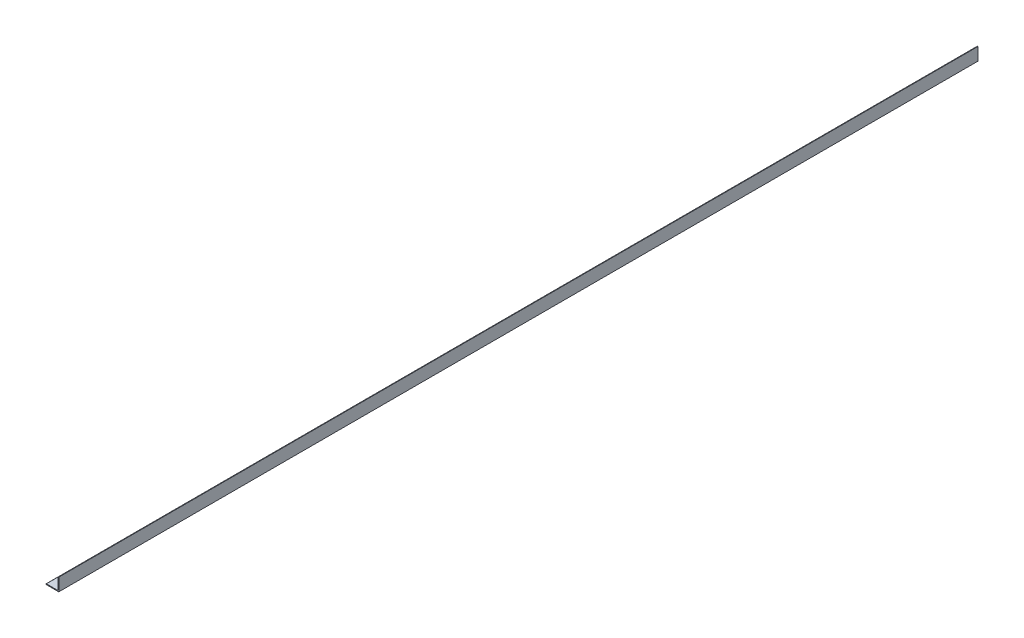
ISO-10303-21;
HEADER;
FILE_DESCRIPTION(('STEP AP214'),'2;1');
FILE_NAME('part.step','',(''),(''),'','','');
FILE_SCHEMA(('AUTOMOTIVE_DESIGN { 1 0 10303 214 1 1 1 1 }'));
ENDSEC;
DATA;
#1=APPLICATION_CONTEXT('core data for automotive mechanical design processes');
#2=APPLICATION_PROTOCOL_DEFINITION('international standard','automotive_design',2000,#1);
#3=PRODUCT_CONTEXT('',#1,'mechanical');
#4=PRODUCT('Part','Part','',(#3));
#5=PRODUCT_RELATED_PRODUCT_CATEGORY('part','',(#4));
#6=PRODUCT_DEFINITION_FORMATION('','',#4);
#7=PRODUCT_DEFINITION_CONTEXT('part definition',#1,'design');
#8=PRODUCT_DEFINITION('design','',#6,#7);
#9=PRODUCT_DEFINITION_SHAPE('','',#8);
#10=(LENGTH_UNIT() NAMED_UNIT(*) SI_UNIT(.MILLI.,.METRE.));
#11=(NAMED_UNIT(*) PLANE_ANGLE_UNIT() SI_UNIT($,.RADIAN.));
#12=(NAMED_UNIT(*) SI_UNIT($,.STERADIAN.) SOLID_ANGLE_UNIT());
#13=UNCERTAINTY_MEASURE_WITH_UNIT(LENGTH_MEASURE(1.E-05),#10,'distance_accuracy_value','');
#14=(GEOMETRIC_REPRESENTATION_CONTEXT(3) GLOBAL_UNCERTAINTY_ASSIGNED_CONTEXT((#13)) GLOBAL_UNIT_ASSIGNED_CONTEXT((#10,
#11,#12)) REPRESENTATION_CONTEXT('',''));
#15=CARTESIAN_POINT('',(0.,0.,0.));
#16=DIRECTION('',(0.,0.,1.));
#17=DIRECTION('',(1.,0.,0.));
#18=AXIS2_PLACEMENT_3D('',#15,#16,#17);
#19=CARTESIAN_POINT('',(-12.7,-11.90625,914.4));
#20=DIRECTION('',(1.,0.,0.));
#21=DIRECTION('',(0.,0.,-1.));
#22=AXIS2_PLACEMENT_3D('',#19,#20,#21);
#23=PLANE('',#22);
#24=DIRECTION('',(0.,-1.,0.));
#25=VECTOR('',#24,1.);
#26=CARTESIAN_POINT('',(-12.7,-11.90625,-914.4));
#27=LINE('',#26,#25);
#28=CARTESIAN_POINT('',(-12.7,-11.90625,-914.4));
#29=VERTEX_POINT('',#28);
#30=CARTESIAN_POINT('',(-12.7,-12.7,-914.4));
#31=VERTEX_POINT('',#30);
#32=EDGE_CURVE('E361',#29,#31,#27,.T.);
#33=ORIENTED_EDGE('',*,*,#32,.T.);
#34=DIRECTION('',(0.,0.,-1.));
#35=VECTOR('',#34,1.);
#36=CARTESIAN_POINT('',(-12.7,-12.7,914.4));
#37=LINE('',#36,#35);
#38=CARTESIAN_POINT('',(-12.7,-12.7,914.4));
#39=VERTEX_POINT('',#38);
#40=EDGE_CURVE('E11',#39,#31,#37,.T.);
#41=ORIENTED_EDGE('',*,*,#40,.F.);
#42=DIRECTION('',(0.,-1.,0.));
#43=VECTOR('',#42,1.);
#44=CARTESIAN_POINT('',(-12.7,-11.90625,914.4));
#45=LINE('',#44,#43);
#46=CARTESIAN_POINT('',(-12.7,-11.90625,914.4));
#47=VERTEX_POINT('',#46);
#48=EDGE_CURVE('E362',#47,#39,#45,.T.);
#49=ORIENTED_EDGE('',*,*,#48,.F.);
#50=DIRECTION('',(0.,0.,-1.));
#51=VECTOR('',#50,1.);
#52=CARTESIAN_POINT('',(-12.7,-11.90625,914.4));
#53=LINE('',#52,#51);
#54=EDGE_CURVE('E382',#47,#29,#53,.T.);
#55=ORIENTED_EDGE('',*,*,#54,.T.);
#56=EDGE_LOOP('',(#33,#41,#49,#55));
#57=FACE_BOUND('',#56,.T.);
#58=ADVANCED_FACE('F37',(#57),#23,.F.);
#59=CARTESIAN_POINT('',(-12.7,-12.7,914.4));
#60=DIRECTION('',(0.,1.,0.));
#61=DIRECTION('',(-1.,0.,0.));
#62=AXIS2_PLACEMENT_3D('',#59,#60,#61);
#63=PLANE('',#62);
#64=DIRECTION('',(0.,0.,-1.));
#65=VECTOR('',#64,1.);
#66=CARTESIAN_POINT('',(1.4605,-12.7,701.675));
#67=LINE('',#66,#65);
#68=CARTESIAN_POINT('',(1.4605,-12.7,720.725));
#69=VERTEX_POINT('',#68);
#70=CARTESIAN_POINT('',(1.4605,-12.7,701.675));
#71=VERTEX_POINT('',#70);
#72=EDGE_CURVE('E215',#69,#71,#67,.T.);
#73=ORIENTED_EDGE('',*,*,#72,.T.);
#74=CARTESIAN_POINT('',(-1.5875,-12.7,701.675));
#75=DIRECTION('',(0.,1.,0.));
#76=DIRECTION('',(0.,0.,1.));
#77=AXIS2_PLACEMENT_3D('',#74,#75,#76);
#78=CIRCLE('',#77,3.048);
#79=CARTESIAN_POINT('',(-4.6355,-12.7,701.675));
#80=VERTEX_POINT('',#79);
#81=EDGE_CURVE('E207',#71,#80,#78,.T.);
#82=ORIENTED_EDGE('',*,*,#81,.T.);
#83=DIRECTION('',(0.,0.,1.));
#84=VECTOR('',#83,1.);
#85=CARTESIAN_POINT('',(-4.6355,-12.7,701.675));
#86=LINE('',#85,#84);
#87=CARTESIAN_POINT('',(-4.63549999999999,-12.7,720.725));
#88=VERTEX_POINT('',#87);
#89=EDGE_CURVE('E218',#80,#88,#86,.T.);
#90=ORIENTED_EDGE('',*,*,#89,.T.);
#91=CARTESIAN_POINT('',(-1.58749999999999,-12.7,720.725));
#92=DIRECTION('',(0.,1.,0.));
#93=DIRECTION('',(0.,0.,1.));
#94=AXIS2_PLACEMENT_3D('',#91,#92,#93);
#95=CIRCLE('',#94,3.048);
#96=EDGE_CURVE('E51',#88,#69,#95,.T.);
#97=ORIENTED_EDGE('',*,*,#96,.T.);
#98=EDGE_LOOP('',(#73,#82,#90,#97));
#99=FACE_BOUND('',#98,.T.);
#100=DIRECTION('',(0.,0.,-1.));
#101=VECTOR('',#100,1.);
#102=CARTESIAN_POINT('',(1.46049999999995,-12.7,285.75));
#103=LINE('',#102,#101);
#104=CARTESIAN_POINT('',(1.46049999999996,-12.7,304.8));
#105=VERTEX_POINT('',#104);
#106=CARTESIAN_POINT('',(1.46049999999995,-12.7,285.75));
#107=VERTEX_POINT('',#106);
#108=EDGE_CURVE('E253',#105,#107,#103,.T.);
#109=ORIENTED_EDGE('',*,*,#108,.T.);
#110=CARTESIAN_POINT('',(-1.58750000000005,-12.7,285.75));
#111=DIRECTION('',(0.,1.,0.));
#112=DIRECTION('',(0.,0.,1.));
#113=AXIS2_PLACEMENT_3D('',#110,#111,#112);
#114=CIRCLE('',#113,3.048);
#115=CARTESIAN_POINT('',(-4.63550000000005,-12.7,285.75));
#116=VERTEX_POINT('',#115);
#117=EDGE_CURVE('E245',#107,#116,#114,.T.);
#118=ORIENTED_EDGE('',*,*,#117,.T.);
#119=DIRECTION('',(0.,0.,1.));
#120=VECTOR('',#119,1.);
#121=CARTESIAN_POINT('',(-4.63550000000005,-12.7,285.75));
#122=LINE('',#121,#120);
#123=CARTESIAN_POINT('',(-4.63550000000004,-12.7,304.8));
#124=VERTEX_POINT('',#123);
#125=EDGE_CURVE('E248',#116,#124,#122,.T.);
#126=ORIENTED_EDGE('',*,*,#125,.T.);
#127=CARTESIAN_POINT('',(-1.58750000000004,-12.7,304.8));
#128=DIRECTION('',(0.,1.,0.));
#129=DIRECTION('',(0.,0.,1.));
#130=AXIS2_PLACEMENT_3D('',#127,#128,#129);
#131=CIRCLE('',#130,3.048);
#132=EDGE_CURVE('E59',#124,#105,#131,.T.);
#133=ORIENTED_EDGE('',*,*,#132,.T.);
#134=EDGE_LOOP('',(#109,#118,#126,#133));
#135=FACE_BOUND('',#134,.T.);
#136=DIRECTION('',(0.,0.,1.));
#137=VECTOR('',#136,1.);
#138=CARTESIAN_POINT('',(-4.63550000000008,-12.7,-317.5));
#139=LINE('',#138,#137);
#140=CARTESIAN_POINT('',(-4.63550000000008,-12.7,-336.55));
#141=VERTEX_POINT('',#140);
#142=CARTESIAN_POINT('',(-4.63550000000008,-12.7,-317.5));
#143=VERTEX_POINT('',#142);
#144=EDGE_CURVE('E285',#141,#143,#139,.T.);
#145=ORIENTED_EDGE('',*,*,#144,.T.);
#146=CARTESIAN_POINT('',(-1.58750000000008,-12.7,-317.5));
#147=DIRECTION('',(0.,1.,0.));
#148=DIRECTION('',(0.,0.,-1.));
#149=AXIS2_PLACEMENT_3D('',#146,#147,#148);
#150=CIRCLE('',#149,3.048);
#151=CARTESIAN_POINT('',(1.46049999999992,-12.7,-317.5));
#152=VERTEX_POINT('',#151);
#153=EDGE_CURVE('E275',#143,#152,#150,.T.);
#154=ORIENTED_EDGE('',*,*,#153,.T.);
#155=DIRECTION('',(0.,0.,-1.));
#156=VECTOR('',#155,1.);
#157=CARTESIAN_POINT('',(1.46049999999992,-12.7,-317.5));
#158=LINE('',#157,#156);
#159=CARTESIAN_POINT('',(1.46049999999992,-12.7,-336.55));
#160=VERTEX_POINT('',#159);
#161=EDGE_CURVE('E278',#152,#160,#158,.T.);
#162=ORIENTED_EDGE('',*,*,#161,.T.);
#163=CARTESIAN_POINT('',(-1.58750000000008,-12.7,-336.55));
#164=DIRECTION('',(0.,1.,0.));
#165=DIRECTION('',(0.,0.,-1.));
#166=AXIS2_PLACEMENT_3D('',#163,#164,#165);
#167=CIRCLE('',#166,3.048);
#168=EDGE_CURVE('E282',#160,#141,#167,.T.);
#169=ORIENTED_EDGE('',*,*,#168,.T.);
#170=EDGE_LOOP('',(#145,#154,#162,#169));
#171=FACE_BOUND('',#170,.T.);
#172=DIRECTION('',(0.,0.,1.));
#173=VECTOR('',#172,1.);
#174=CARTESIAN_POINT('',(-4.63550000000002,-12.7,-717.55));
#175=LINE('',#174,#173);
#176=CARTESIAN_POINT('',(-4.63550000000002,-12.7,-736.6));
#177=VERTEX_POINT('',#176);
#178=CARTESIAN_POINT('',(-4.63550000000002,-12.7,-717.55));
#179=VERTEX_POINT('',#178);
#180=EDGE_CURVE('E317',#177,#179,#175,.T.);
#181=ORIENTED_EDGE('',*,*,#180,.T.);
#182=CARTESIAN_POINT('',(-1.58750000000002,-12.7,-717.55));
#183=DIRECTION('',(0.,1.,0.));
#184=DIRECTION('',(0.,0.,-1.));
#185=AXIS2_PLACEMENT_3D('',#182,#183,#184);
#186=CIRCLE('',#185,3.048);
#187=CARTESIAN_POINT('',(1.46049999999998,-12.7,-717.55));
#188=VERTEX_POINT('',#187);
#189=EDGE_CURVE('E307',#179,#188,#186,.T.);
#190=ORIENTED_EDGE('',*,*,#189,.T.);
#191=DIRECTION('',(0.,0.,-1.));
#192=VECTOR('',#191,1.);
#193=CARTESIAN_POINT('',(1.46049999999998,-12.7,-717.55));
#194=LINE('',#193,#192);
#195=CARTESIAN_POINT('',(1.46049999999998,-12.7,-736.6));
#196=VERTEX_POINT('',#195);
#197=EDGE_CURVE('E310',#188,#196,#194,.T.);
#198=ORIENTED_EDGE('',*,*,#197,.T.);
#199=CARTESIAN_POINT('',(-1.58750000000002,-12.7,-736.6));
#200=DIRECTION('',(0.,1.,0.));
#201=DIRECTION('',(0.,0.,-1.));
#202=AXIS2_PLACEMENT_3D('',#199,#200,#201);
#203=CIRCLE('',#202,3.048);
#204=EDGE_CURVE('E314',#196,#177,#203,.T.);
#205=ORIENTED_EDGE('',*,*,#204,.T.);
#206=EDGE_LOOP('',(#181,#190,#198,#205));
#207=FACE_BOUND('',#206,.T.);
#208=CARTESIAN_POINT('',(-1.5875,-12.7,661.924));
#209=DIRECTION('',(0.,1.,0.));
#210=DIRECTION('',(0.,0.,1.));
#211=AXIS2_PLACEMENT_3D('',#208,#209,#210);
#212=CIRCLE('',#211,2.5527);
#213=CARTESIAN_POINT('',(-1.5875,-12.7,664.4767));
#214=VERTEX_POINT('',#213);
#215=EDGE_CURVE('E340',#214,#214,#212,.T.);
#216=ORIENTED_EDGE('',*,*,#215,.T.);
#217=EDGE_LOOP('',(#216));
#218=FACE_BOUND('',#217,.T.);
#219=CARTESIAN_POINT('',(-1.5875,-12.7,206.248));
#220=DIRECTION('',(0.,1.,0.));
#221=DIRECTION('',(0.,0.,1.));
#222=AXIS2_PLACEMENT_3D('',#219,#220,#221);
#223=CIRCLE('',#222,2.5527);
#224=CARTESIAN_POINT('',(-1.5875,-12.7,208.8007));
#225=VERTEX_POINT('',#224);
#226=EDGE_CURVE('E346',#225,#225,#223,.T.);
#227=ORIENTED_EDGE('',*,*,#226,.T.);
#228=EDGE_LOOP('',(#227));
#229=FACE_BOUND('',#228,.T.);
#230=CARTESIAN_POINT('',(-1.5875,-12.7,-705.104));
#231=DIRECTION('',(0.,1.,0.));
#232=DIRECTION('',(0.,0.,1.));
#233=AXIS2_PLACEMENT_3D('',#230,#231,#232);
#234=CIRCLE('',#233,2.5527);
#235=CARTESIAN_POINT('',(-1.5875,-12.7,-702.5513));
#236=VERTEX_POINT('',#235);
#237=EDGE_CURVE('E352',#236,#236,#234,.T.);
#238=ORIENTED_EDGE('',*,*,#237,.T.);
#239=EDGE_LOOP('',(#238));
#240=FACE_BOUND('',#239,.T.);
#241=CARTESIAN_POINT('',(-1.5875,-12.7,-249.428));
#242=DIRECTION('',(0.,1.,0.));
#243=DIRECTION('',(0.,0.,1.));
#244=AXIS2_PLACEMENT_3D('',#241,#242,#243);
#245=CIRCLE('',#244,2.5527);
#246=CARTESIAN_POINT('',(-1.5875,-12.7,-246.8753));
#247=VERTEX_POINT('',#246);
#248=EDGE_CURVE('E358',#247,#247,#245,.T.);
#249=ORIENTED_EDGE('',*,*,#248,.T.);
#250=EDGE_LOOP('',(#249));
#251=FACE_BOUND('',#250,.T.);
#252=DIRECTION('',(1.,0.,0.));
#253=VECTOR('',#252,1.);
#254=CARTESIAN_POINT('',(-12.7,-12.7,-914.4));
#255=LINE('',#254,#253);
#256=CARTESIAN_POINT('',(12.7,-12.7,-914.4));
#257=VERTEX_POINT('',#256);
#258=EDGE_CURVE('E385',#31,#257,#255,.T.);
#259=ORIENTED_EDGE('',*,*,#258,.T.);
#260=DIRECTION('',(0.,0.,-1.));
#261=VECTOR('',#260,1.);
#262=CARTESIAN_POINT('',(12.7,-12.7,914.4));
#263=LINE('',#262,#261);
#264=CARTESIAN_POINT('',(12.7,-12.7,914.4));
#265=VERTEX_POINT('',#264);
#266=EDGE_CURVE('E44',#265,#257,#263,.T.);
#267=ORIENTED_EDGE('',*,*,#266,.F.);
#268=DIRECTION('',(1.,0.,0.));
#269=VECTOR('',#268,1.);
#270=CARTESIAN_POINT('',(-12.7,-12.7,914.4));
#271=LINE('',#270,#269);
#272=EDGE_CURVE('E365',#39,#265,#271,.T.);
#273=ORIENTED_EDGE('',*,*,#272,.F.);
#274=ORIENTED_EDGE('',*,*,#40,.T.);
#275=EDGE_LOOP('',(#259,#267,#273,#274));
#276=FACE_BOUND('',#275,.T.);
#277=ADVANCED_FACE('F222',(#99,#135,#171,#207,#218,#229,#240,#251,#276),#63,.F.);
#278=CARTESIAN_POINT('',(12.7,-12.7,914.4));
#279=DIRECTION('',(-1.,0.,0.));
#280=DIRECTION('',(0.,-1.,0.));
#281=AXIS2_PLACEMENT_3D('',#278,#279,#280);
#282=PLANE('',#281);
#283=DIRECTION('',(0.,1.,0.));
#284=VECTOR('',#283,1.);
#285=CARTESIAN_POINT('',(12.7,-12.7,-914.4));
#286=LINE('',#285,#284);
#287=CARTESIAN_POINT('',(12.7,12.7,-914.4));
#288=VERTEX_POINT('',#287);
#289=EDGE_CURVE('E387',#257,#288,#286,.T.);
#290=ORIENTED_EDGE('',*,*,#289,.T.);
#291=DIRECTION('',(0.,0.,-1.));
#292=VECTOR('',#291,1.);
#293=CARTESIAN_POINT('',(12.7,12.7,914.4));
#294=LINE('',#293,#292);
#295=CARTESIAN_POINT('',(12.7,12.7,914.4));
#296=VERTEX_POINT('',#295);
#297=EDGE_CURVE('E417',#296,#288,#294,.T.);
#298=ORIENTED_EDGE('',*,*,#297,.F.);
#299=DIRECTION('',(0.,1.,0.));
#300=VECTOR('',#299,1.);
#301=CARTESIAN_POINT('',(12.7,-12.7,914.4));
#302=LINE('',#301,#300);
#303=EDGE_CURVE('E368',#265,#296,#302,.T.);
#304=ORIENTED_EDGE('',*,*,#303,.F.);
#305=ORIENTED_EDGE('',*,*,#266,.T.);
#306=EDGE_LOOP('',(#290,#298,#304,#305));
#307=FACE_BOUND('',#306,.T.);
#308=ADVANCED_FACE('F424',(#307),#282,.F.);
#309=CARTESIAN_POINT('',(11.90625,12.7,914.4));
#310=DIRECTION('',(0.,-1.,0.));
#311=DIRECTION('',(0.,0.,-1.));
#312=AXIS2_PLACEMENT_3D('',#309,#310,#311);
#313=PLANE('',#312);
#314=DIRECTION('',(-1.,0.,0.));
#315=VECTOR('',#314,1.);
#316=CARTESIAN_POINT('',(11.90625,12.7,-914.4));
#317=LINE('',#316,#315);
#318=CARTESIAN_POINT('',(11.90625,12.7,-914.4));
#319=VERTEX_POINT('',#318);
#320=EDGE_CURVE('E389',#288,#319,#317,.T.);
#321=ORIENTED_EDGE('',*,*,#320,.T.);
#322=DIRECTION('',(0.,0.,-1.));
#323=VECTOR('',#322,1.);
#324=CARTESIAN_POINT('',(11.90625,12.7,914.4));
#325=LINE('',#324,#323);
#326=CARTESIAN_POINT('',(11.90625,12.7,914.4));
#327=VERTEX_POINT('',#326);
#328=EDGE_CURVE('E414',#327,#319,#325,.T.);
#329=ORIENTED_EDGE('',*,*,#328,.F.);
#330=DIRECTION('',(-1.,0.,0.));
#331=VECTOR('',#330,1.);
#332=CARTESIAN_POINT('',(11.90625,12.7,914.4));
#333=LINE('',#332,#331);
#334=EDGE_CURVE('E370',#296,#327,#333,.T.);
#335=ORIENTED_EDGE('',*,*,#334,.F.);
#336=ORIENTED_EDGE('',*,*,#297,.T.);
#337=EDGE_LOOP('',(#321,#329,#335,#336));
#338=FACE_BOUND('',#337,.T.);
#339=ADVANCED_FACE('F435',(#338),#313,.F.);
#340=CARTESIAN_POINT('',(11.90625,11.90625,914.4));
#341=DIRECTION('',(0.,0.,-1.));
#342=DIRECTION('',(-1.,0.,0.));
#343=AXIS2_PLACEMENT_3D('',#340,#341,#342);
#344=CYLINDRICAL_SURFACE('',#343,0.793749999999998);
#345=CARTESIAN_POINT('',(11.90625,11.90625,-914.4));
#346=DIRECTION('',(0.,0.,1.));
#347=DIRECTION('',(-1.,0.,0.));
#348=AXIS2_PLACEMENT_3D('',#345,#346,#347);
#349=CIRCLE('',#348,0.793749999999998);
#350=CARTESIAN_POINT('',(11.1125,11.90625,-914.4));
#351=VERTEX_POINT('',#350);
#352=EDGE_CURVE('E391',#319,#351,#349,.T.);
#353=ORIENTED_EDGE('',*,*,#352,.T.);
#354=DIRECTION('',(0.,0.,-1.));
#355=VECTOR('',#354,1.);
#356=CARTESIAN_POINT('',(11.1125,11.90625,914.4));
#357=LINE('',#356,#355);
#358=CARTESIAN_POINT('',(11.1125,11.90625,914.4));
#359=VERTEX_POINT('',#358);
#360=EDGE_CURVE('E411',#359,#351,#357,.T.);
#361=ORIENTED_EDGE('',*,*,#360,.F.);
#362=CARTESIAN_POINT('',(11.90625,11.90625,914.4));
#363=DIRECTION('',(0.,0.,1.));
#364=DIRECTION('',(-1.,0.,0.));
#365=AXIS2_PLACEMENT_3D('',#362,#363,#364);
#366=CIRCLE('',#365,0.793749999999998);
#367=EDGE_CURVE('E372',#327,#359,#366,.T.);
#368=ORIENTED_EDGE('',*,*,#367,.F.);
#369=ORIENTED_EDGE('',*,*,#328,.T.);
#370=EDGE_LOOP('',(#353,#361,#368,#369));
#371=FACE_BOUND('',#370,.T.);
#372=ADVANCED_FACE('F439',(#371),#344,.T.);
#373=CARTESIAN_POINT('',(11.1125,11.90625,914.4));
#374=DIRECTION('',(1.,0.,0.));
#375=DIRECTION('',(0.,1.,0.));
#376=AXIS2_PLACEMENT_3D('',#373,#374,#375);
#377=PLANE('',#376);
#378=DIRECTION('',(0.,-1.,0.));
#379=VECTOR('',#378,1.);
#380=CARTESIAN_POINT('',(11.1125,11.90625,-914.4));
#381=LINE('',#380,#379);
#382=CARTESIAN_POINT('',(11.1125,-9.5377,-914.4));
#383=VERTEX_POINT('',#382);
#384=EDGE_CURVE('E393',#351,#383,#381,.T.);
#385=ORIENTED_EDGE('',*,*,#384,.T.);
#386=DIRECTION('',(0.,0.,-1.));
#387=VECTOR('',#386,1.);
#388=CARTESIAN_POINT('',(11.1125,-9.5377,914.4));
#389=LINE('',#388,#387);
#390=CARTESIAN_POINT('',(11.1125,-9.5377,914.4));
#391=VERTEX_POINT('',#390);
#392=EDGE_CURVE('E408',#391,#383,#389,.T.);
#393=ORIENTED_EDGE('',*,*,#392,.F.);
#394=DIRECTION('',(0.,-1.,0.));
#395=VECTOR('',#394,1.);
#396=CARTESIAN_POINT('',(11.1125,11.90625,914.4));
#397=LINE('',#396,#395);
#398=EDGE_CURVE('E374',#359,#391,#397,.T.);
#399=ORIENTED_EDGE('',*,*,#398,.F.);
#400=ORIENTED_EDGE('',*,*,#360,.T.);
#401=EDGE_LOOP('',(#385,#393,#399,#400));
#402=FACE_BOUND('',#401,.T.);
#403=ADVANCED_FACE('F464',(#402),#377,.F.);
#404=CARTESIAN_POINT('',(9.5377,-9.5377,914.4));
#405=DIRECTION('',(0.,0.,-1.));
#406=DIRECTION('',(-1.,0.,0.));
#407=AXIS2_PLACEMENT_3D('',#404,#405,#406);
#408=CYLINDRICAL_SURFACE('',#407,1.5748);
#409=CARTESIAN_POINT('',(9.5377,-9.5377,-914.4));
#410=DIRECTION('',(0.,0.,-1.));
#411=DIRECTION('',(-1.,0.,0.));
#412=AXIS2_PLACEMENT_3D('',#409,#410,#411);
#413=CIRCLE('',#412,1.5748);
#414=CARTESIAN_POINT('',(9.5377,-11.1125,-914.4));
#415=VERTEX_POINT('',#414);
#416=EDGE_CURVE('E395',#383,#415,#413,.T.);
#417=ORIENTED_EDGE('',*,*,#416,.T.);
#418=DIRECTION('',(0.,0.,-1.));
#419=VECTOR('',#418,1.);
#420=CARTESIAN_POINT('',(9.5377,-11.1125,914.4));
#421=LINE('',#420,#419);
#422=CARTESIAN_POINT('',(9.5377,-11.1125,914.4));
#423=VERTEX_POINT('',#422);
#424=EDGE_CURVE('E405',#423,#415,#421,.T.);
#425=ORIENTED_EDGE('',*,*,#424,.F.);
#426=CARTESIAN_POINT('',(9.5377,-9.5377,914.4));
#427=DIRECTION('',(0.,0.,-1.));
#428=DIRECTION('',(-1.,0.,0.));
#429=AXIS2_PLACEMENT_3D('',#426,#427,#428);
#430=CIRCLE('',#429,1.5748);
#431=EDGE_CURVE('E376',#391,#423,#430,.T.);
#432=ORIENTED_EDGE('',*,*,#431,.F.);
#433=ORIENTED_EDGE('',*,*,#392,.T.);
#434=EDGE_LOOP('',(#417,#425,#432,#433));
#435=FACE_BOUND('',#434,.T.);
#436=ADVANCED_FACE('F462',(#435),#408,.F.);
#437=CARTESIAN_POINT('',(9.5377,-11.1125,914.4));
#438=DIRECTION('',(0.,-1.,0.));
#439=DIRECTION('',(0.,0.,-1.));
#440=AXIS2_PLACEMENT_3D('',#437,#438,#439);
#441=PLANE('',#440);
#442=DIRECTION('',(0.,0.,1.));
#443=VECTOR('',#442,1.);
#444=CARTESIAN_POINT('',(-4.6355,-11.1125,701.675));
#445=LINE('',#444,#443);
#446=CARTESIAN_POINT('',(-4.6355,-11.1125,701.675));
#447=VERTEX_POINT('',#446);
#448=CARTESIAN_POINT('',(-4.63549999999999,-11.1125,720.725));
#449=VERTEX_POINT('',#448);
#450=EDGE_CURVE('E234',#447,#449,#445,.T.);
#451=ORIENTED_EDGE('',*,*,#450,.F.);
#452=CARTESIAN_POINT('',(-1.5875,-11.1125,701.675));
#453=DIRECTION('',(0.,1.,0.));
#454=DIRECTION('',(0.,0.,1.));
#455=AXIS2_PLACEMENT_3D('',#452,#453,#454);
#456=CIRCLE('',#455,3.048);
#457=CARTESIAN_POINT('',(1.4605,-11.1125,701.675));
#458=VERTEX_POINT('',#457);
#459=EDGE_CURVE('E210',#458,#447,#456,.T.);
#460=ORIENTED_EDGE('',*,*,#459,.F.);
#461=DIRECTION('',(0.,0.,-1.));
#462=VECTOR('',#461,1.);
#463=CARTESIAN_POINT('',(1.4605,-11.1125,701.675));
#464=LINE('',#463,#462);
#465=CARTESIAN_POINT('',(1.4605,-11.1125,720.725));
#466=VERTEX_POINT('',#465);
#467=EDGE_CURVE('E225',#466,#458,#464,.T.);
#468=ORIENTED_EDGE('',*,*,#467,.F.);
#469=CARTESIAN_POINT('',(-1.58749999999999,-11.1125,720.725));
#470=DIRECTION('',(0.,1.,0.));
#471=DIRECTION('',(0.,0.,1.));
#472=AXIS2_PLACEMENT_3D('',#469,#470,#471);
#473=CIRCLE('',#472,3.048);
#474=EDGE_CURVE('E228',#449,#466,#473,.T.);
#475=ORIENTED_EDGE('',*,*,#474,.F.);
#476=EDGE_LOOP('',(#451,#460,#468,#475));
#477=FACE_BOUND('',#476,.T.);
#478=DIRECTION('',(0.,0.,1.));
#479=VECTOR('',#478,1.);
#480=CARTESIAN_POINT('',(-4.63550000000005,-11.1125,285.75));
#481=LINE('',#480,#479);
#482=CARTESIAN_POINT('',(-4.63550000000005,-11.1125,285.75));
#483=VERTEX_POINT('',#482);
#484=CARTESIAN_POINT('',(-4.63550000000004,-11.1125,304.8));
#485=VERTEX_POINT('',#484);
#486=EDGE_CURVE('E259',#483,#485,#481,.T.);
#487=ORIENTED_EDGE('',*,*,#486,.F.);
#488=CARTESIAN_POINT('',(-1.58750000000005,-11.1125,285.75));
#489=DIRECTION('',(0.,1.,0.));
#490=DIRECTION('',(0.,0.,1.));
#491=AXIS2_PLACEMENT_3D('',#488,#489,#490);
#492=CIRCLE('',#491,3.048);
#493=CARTESIAN_POINT('',(1.46049999999995,-11.1125,285.75));
#494=VERTEX_POINT('',#493);
#495=EDGE_CURVE('E257',#494,#483,#492,.T.);
#496=ORIENTED_EDGE('',*,*,#495,.F.);
#497=DIRECTION('',(0.,0.,-1.));
#498=VECTOR('',#497,1.);
#499=CARTESIAN_POINT('',(1.46049999999995,-11.1125,285.75));
#500=LINE('',#499,#498);
#501=CARTESIAN_POINT('',(1.46049999999996,-11.1125,304.8));
#502=VERTEX_POINT('',#501);
#503=EDGE_CURVE('E249',#502,#494,#500,.T.);
#504=ORIENTED_EDGE('',*,*,#503,.F.);
#505=CARTESIAN_POINT('',(-1.58750000000004,-11.1125,304.8));
#506=DIRECTION('',(0.,1.,0.));
#507=DIRECTION('',(0.,0.,1.));
#508=AXIS2_PLACEMENT_3D('',#505,#506,#507);
#509=CIRCLE('',#508,3.048);
#510=EDGE_CURVE('E263',#485,#502,#509,.T.);
#511=ORIENTED_EDGE('',*,*,#510,.F.);
#512=EDGE_LOOP('',(#487,#496,#504,#511));
#513=FACE_BOUND('',#512,.T.);
#514=DIRECTION('',(0.,0.,-1.));
#515=VECTOR('',#514,1.);
#516=CARTESIAN_POINT('',(1.46049999999992,-11.1125,-317.5));
#517=LINE('',#516,#515);
#518=CARTESIAN_POINT('',(1.46049999999992,-11.1125,-317.5));
#519=VERTEX_POINT('',#518);
#520=CARTESIAN_POINT('',(1.46049999999992,-11.1125,-336.55));
#521=VERTEX_POINT('',#520);
#522=EDGE_CURVE('E291',#519,#521,#517,.T.);
#523=ORIENTED_EDGE('',*,*,#522,.F.);
#524=CARTESIAN_POINT('',(-1.58750000000008,-11.1125,-317.5));
#525=DIRECTION('',(0.,1.,0.));
#526=DIRECTION('',(0.,0.,-1.));
#527=AXIS2_PLACEMENT_3D('',#524,#525,#526);
#528=CIRCLE('',#527,3.048);
#529=CARTESIAN_POINT('',(-4.63550000000008,-11.1125,-317.5));
#530=VERTEX_POINT('',#529);
#531=EDGE_CURVE('E289',#530,#519,#528,.T.);
#532=ORIENTED_EDGE('',*,*,#531,.F.);
#533=DIRECTION('',(0.,0.,1.));
#534=VECTOR('',#533,1.);
#535=CARTESIAN_POINT('',(-4.63550000000008,-11.1125,-317.5));
#536=LINE('',#535,#534);
#537=CARTESIAN_POINT('',(-4.63550000000008,-11.1125,-336.55));
#538=VERTEX_POINT('',#537);
#539=EDGE_CURVE('E279',#538,#530,#536,.T.);
#540=ORIENTED_EDGE('',*,*,#539,.F.);
#541=CARTESIAN_POINT('',(-1.58750000000008,-11.1125,-336.55));
#542=DIRECTION('',(0.,1.,0.));
#543=DIRECTION('',(0.,0.,-1.));
#544=AXIS2_PLACEMENT_3D('',#541,#542,#543);
#545=CIRCLE('',#544,3.048);
#546=EDGE_CURVE('E295',#521,#538,#545,.T.);
#547=ORIENTED_EDGE('',*,*,#546,.F.);
#548=EDGE_LOOP('',(#523,#532,#540,#547));
#549=FACE_BOUND('',#548,.T.);
#550=DIRECTION('',(0.,0.,-1.));
#551=VECTOR('',#550,1.);
#552=CARTESIAN_POINT('',(1.46049999999998,-11.1125,-717.55));
#553=LINE('',#552,#551);
#554=CARTESIAN_POINT('',(1.46049999999998,-11.1125,-717.55));
#555=VERTEX_POINT('',#554);
#556=CARTESIAN_POINT('',(1.46049999999998,-11.1125,-736.6));
#557=VERTEX_POINT('',#556);
#558=EDGE_CURVE('E323',#555,#557,#553,.T.);
#559=ORIENTED_EDGE('',*,*,#558,.F.);
#560=CARTESIAN_POINT('',(-1.58750000000002,-11.1125,-717.55));
#561=DIRECTION('',(0.,1.,0.));
#562=DIRECTION('',(0.,0.,-1.));
#563=AXIS2_PLACEMENT_3D('',#560,#561,#562);
#564=CIRCLE('',#563,3.048);
#565=CARTESIAN_POINT('',(-4.63550000000002,-11.1125,-717.55));
#566=VERTEX_POINT('',#565);
#567=EDGE_CURVE('E321',#566,#555,#564,.T.);
#568=ORIENTED_EDGE('',*,*,#567,.F.);
#569=DIRECTION('',(0.,0.,1.));
#570=VECTOR('',#569,1.);
#571=CARTESIAN_POINT('',(-4.63550000000002,-11.1125,-717.55));
#572=LINE('',#571,#570);
#573=CARTESIAN_POINT('',(-4.63550000000002,-11.1125,-736.6));
#574=VERTEX_POINT('',#573);
#575=EDGE_CURVE('E311',#574,#566,#572,.T.);
#576=ORIENTED_EDGE('',*,*,#575,.F.);
#577=CARTESIAN_POINT('',(-1.58750000000002,-11.1125,-736.6));
#578=DIRECTION('',(0.,1.,0.));
#579=DIRECTION('',(0.,0.,-1.));
#580=AXIS2_PLACEMENT_3D('',#577,#578,#579);
#581=CIRCLE('',#580,3.048);
#582=EDGE_CURVE('E326',#557,#574,#581,.T.);
#583=ORIENTED_EDGE('',*,*,#582,.F.);
#584=EDGE_LOOP('',(#559,#568,#576,#583));
#585=FACE_BOUND('',#584,.T.);
#586=CARTESIAN_POINT('',(-1.5875,-11.1125,661.924));
#587=DIRECTION('',(0.,1.,0.));
#588=DIRECTION('',(0.,0.,1.));
#589=AXIS2_PLACEMENT_3D('',#586,#587,#588);
#590=CIRCLE('',#589,2.55269999999999);
#591=CARTESIAN_POINT('',(-1.5875,-11.1125,664.4767));
#592=VERTEX_POINT('',#591);
#593=EDGE_CURVE('E241',#592,#592,#590,.T.);
#594=ORIENTED_EDGE('',*,*,#593,.F.);
#595=EDGE_LOOP('',(#594));
#596=FACE_BOUND('',#595,.T.);
#597=CARTESIAN_POINT('',(-1.5875,-11.1125,206.248));
#598=DIRECTION('',(0.,1.,0.));
#599=DIRECTION('',(0.,0.,1.));
#600=AXIS2_PLACEMENT_3D('',#597,#598,#599);
#601=CIRCLE('',#600,2.55269999999999);
#602=CARTESIAN_POINT('',(-1.5875,-11.1125,208.8007));
#603=VERTEX_POINT('',#602);
#604=EDGE_CURVE('E343',#603,#603,#601,.T.);
#605=ORIENTED_EDGE('',*,*,#604,.F.);
#606=EDGE_LOOP('',(#605));
#607=FACE_BOUND('',#606,.T.);
#608=CARTESIAN_POINT('',(-1.5875,-11.1125,-705.104));
#609=DIRECTION('',(0.,1.,0.));
#610=DIRECTION('',(0.,0.,1.));
#611=AXIS2_PLACEMENT_3D('',#608,#609,#610);
#612=CIRCLE('',#611,2.55269999999999);
#613=CARTESIAN_POINT('',(-1.5875,-11.1125,-702.5513));
#614=VERTEX_POINT('',#613);
#615=EDGE_CURVE('E349',#614,#614,#612,.T.);
#616=ORIENTED_EDGE('',*,*,#615,.F.);
#617=EDGE_LOOP('',(#616));
#618=FACE_BOUND('',#617,.T.);
#619=CARTESIAN_POINT('',(-1.5875,-11.1125,-249.428));
#620=DIRECTION('',(0.,1.,0.));
#621=DIRECTION('',(0.,0.,1.));
#622=AXIS2_PLACEMENT_3D('',#619,#620,#621);
#623=CIRCLE('',#622,2.55269999999999);
#624=CARTESIAN_POINT('',(-1.5875,-11.1125,-246.8753));
#625=VERTEX_POINT('',#624);
#626=EDGE_CURVE('E355',#625,#625,#623,.T.);
#627=ORIENTED_EDGE('',*,*,#626,.F.);
#628=EDGE_LOOP('',(#627));
#629=FACE_BOUND('',#628,.T.);
#630=DIRECTION('',(-1.,0.,0.));
#631=VECTOR('',#630,1.);
#632=CARTESIAN_POINT('',(9.5377,-11.1125,-914.4));
#633=LINE('',#632,#631);
#634=CARTESIAN_POINT('',(-11.90625,-11.1125,-914.4));
#635=VERTEX_POINT('',#634);
#636=EDGE_CURVE('E397',#415,#635,#633,.T.);
#637=ORIENTED_EDGE('',*,*,#636,.T.);
#638=DIRECTION('',(0.,0.,-1.));
#639=VECTOR('',#638,1.);
#640=CARTESIAN_POINT('',(-11.90625,-11.1125,914.4));
#641=LINE('',#640,#639);
#642=CARTESIAN_POINT('',(-11.90625,-11.1125,914.4));
#643=VERTEX_POINT('',#642);
#644=EDGE_CURVE('E402',#643,#635,#641,.T.);
#645=ORIENTED_EDGE('',*,*,#644,.F.);
#646=DIRECTION('',(-1.,0.,0.));
#647=VECTOR('',#646,1.);
#648=CARTESIAN_POINT('',(9.5377,-11.1125,914.4));
#649=LINE('',#648,#647);
#650=EDGE_CURVE('E378',#423,#643,#649,.T.);
#651=ORIENTED_EDGE('',*,*,#650,.F.);
#652=ORIENTED_EDGE('',*,*,#424,.T.);
#653=EDGE_LOOP('',(#637,#645,#651,#652));
#654=FACE_BOUND('',#653,.T.);
#655=ADVANCED_FACE('F458',(#477,#513,#549,#585,#596,#607,#618,#629,#654),#441,.F.);
#656=CARTESIAN_POINT('',(-11.90625,-11.90625,914.4));
#657=DIRECTION('',(0.,0.,-1.));
#658=DIRECTION('',(-1.,0.,0.));
#659=AXIS2_PLACEMENT_3D('',#656,#657,#658);
#660=CYLINDRICAL_SURFACE('',#659,0.79375);
#661=CARTESIAN_POINT('',(-11.90625,-11.90625,-914.4));
#662=DIRECTION('',(0.,0.,1.));
#663=DIRECTION('',(-1.,0.,0.));
#664=AXIS2_PLACEMENT_3D('',#661,#662,#663);
#665=CIRCLE('',#664,0.79375);
#666=EDGE_CURVE('E366',#635,#29,#665,.T.);
#667=ORIENTED_EDGE('',*,*,#666,.T.);
#668=ORIENTED_EDGE('',*,*,#54,.F.);
#669=CARTESIAN_POINT('',(-11.90625,-11.90625,914.4));
#670=DIRECTION('',(0.,0.,1.));
#671=DIRECTION('',(-1.,0.,0.));
#672=AXIS2_PLACEMENT_3D('',#669,#670,#671);
#673=CIRCLE('',#672,0.79375);
#674=EDGE_CURVE('E380',#643,#47,#673,.T.);
#675=ORIENTED_EDGE('',*,*,#674,.F.);
#676=ORIENTED_EDGE('',*,*,#644,.T.);
#677=EDGE_LOOP('',(#667,#668,#675,#676));
#678=FACE_BOUND('',#677,.T.);
#679=ADVANCED_FACE('F453',(#678),#660,.T.);
#680=CARTESIAN_POINT('',(11.90625,11.90625,914.4));
#681=DIRECTION('',(0.,0.,-1.));
#682=DIRECTION('',(-1.,0.,0.));
#683=AXIS2_PLACEMENT_3D('',#680,#681,#682);
#684=PLANE('',#683);
#685=ORIENTED_EDGE('',*,*,#48,.T.);
#686=ORIENTED_EDGE('',*,*,#272,.T.);
#687=ORIENTED_EDGE('',*,*,#303,.T.);
#688=ORIENTED_EDGE('',*,*,#334,.T.);
#689=ORIENTED_EDGE('',*,*,#367,.T.);
#690=ORIENTED_EDGE('',*,*,#398,.T.);
#691=ORIENTED_EDGE('',*,*,#431,.T.);
#692=ORIENTED_EDGE('',*,*,#650,.T.);
#693=ORIENTED_EDGE('',*,*,#674,.T.);
#694=EDGE_LOOP('',(#685,#686,#687,#688,#689,#690,#691,#692,#693));
#695=FACE_BOUND('',#694,.T.);
#696=ADVANCED_FACE('F443',(#695),#684,.F.);
#697=CARTESIAN_POINT('',(11.90625,11.90625,-914.4));
#698=DIRECTION('',(0.,0.,-1.));
#699=DIRECTION('',(-1.,0.,0.));
#700=AXIS2_PLACEMENT_3D('',#697,#698,#699);
#701=PLANE('',#700);
#702=ORIENTED_EDGE('',*,*,#32,.F.);
#703=ORIENTED_EDGE('',*,*,#666,.F.);
#704=ORIENTED_EDGE('',*,*,#636,.F.);
#705=ORIENTED_EDGE('',*,*,#416,.F.);
#706=ORIENTED_EDGE('',*,*,#384,.F.);
#707=ORIENTED_EDGE('',*,*,#352,.F.);
#708=ORIENTED_EDGE('',*,*,#320,.F.);
#709=ORIENTED_EDGE('',*,*,#289,.F.);
#710=ORIENTED_EDGE('',*,*,#258,.F.);
#711=EDGE_LOOP('',(#702,#703,#704,#705,#706,#707,#708,#709,#710));
#712=FACE_BOUND('',#711,.T.);
#713=ADVANCED_FACE('F430',(#712),#701,.T.);
#714=CARTESIAN_POINT('',(-1.5875,-11.1125,-249.428));
#715=DIRECTION('',(0.,1.,0.));
#716=DIRECTION('',(0.,0.,1.));
#717=AXIS2_PLACEMENT_3D('',#714,#715,#716);
#718=CYLINDRICAL_SURFACE('',#717,2.55269999999999);
#719=ORIENTED_EDGE('',*,*,#248,.F.);
#720=EDGE_LOOP('',(#719));
#721=FACE_BOUND('',#720,.T.);
#722=ORIENTED_EDGE('',*,*,#626,.T.);
#723=EDGE_LOOP('',(#722));
#724=FACE_BOUND('',#723,.T.);
#725=ADVANCED_FACE('F533',(#721,#724),#718,.F.);
#726=CARTESIAN_POINT('',(-1.5875,-11.1125,-705.104));
#727=DIRECTION('',(0.,1.,0.));
#728=DIRECTION('',(0.,0.,1.));
#729=AXIS2_PLACEMENT_3D('',#726,#727,#728);
#730=CYLINDRICAL_SURFACE('',#729,2.55269999999999);
#731=ORIENTED_EDGE('',*,*,#237,.F.);
#732=EDGE_LOOP('',(#731));
#733=FACE_BOUND('',#732,.T.);
#734=ORIENTED_EDGE('',*,*,#615,.T.);
#735=EDGE_LOOP('',(#734));
#736=FACE_BOUND('',#735,.T.);
#737=ADVANCED_FACE('F543',(#733,#736),#730,.F.);
#738=CARTESIAN_POINT('',(-1.5875,-11.1125,206.248));
#739=DIRECTION('',(0.,1.,0.));
#740=DIRECTION('',(0.,0.,1.));
#741=AXIS2_PLACEMENT_3D('',#738,#739,#740);
#742=CYLINDRICAL_SURFACE('',#741,2.55269999999999);
#743=ORIENTED_EDGE('',*,*,#226,.F.);
#744=EDGE_LOOP('',(#743));
#745=FACE_BOUND('',#744,.T.);
#746=ORIENTED_EDGE('',*,*,#604,.T.);
#747=EDGE_LOOP('',(#746));
#748=FACE_BOUND('',#747,.T.);
#749=ADVANCED_FACE('F554',(#745,#748),#742,.F.);
#750=CARTESIAN_POINT('',(-1.5875,-11.1125,661.924));
#751=DIRECTION('',(0.,1.,0.));
#752=DIRECTION('',(0.,0.,1.));
#753=AXIS2_PLACEMENT_3D('',#750,#751,#752);
#754=CYLINDRICAL_SURFACE('',#753,2.55269999999999);
#755=ORIENTED_EDGE('',*,*,#215,.F.);
#756=EDGE_LOOP('',(#755));
#757=FACE_BOUND('',#756,.T.);
#758=ORIENTED_EDGE('',*,*,#593,.T.);
#759=EDGE_LOOP('',(#758));
#760=FACE_BOUND('',#759,.T.);
#761=ADVANCED_FACE('F564',(#757,#760),#754,.F.);
#762=CARTESIAN_POINT('',(-1.58750000000002,-12.7,-717.55));
#763=DIRECTION('',(0.,1.,0.));
#764=DIRECTION('',(0.,0.,1.));
#765=AXIS2_PLACEMENT_3D('',#762,#763,#764);
#766=CYLINDRICAL_SURFACE('',#765,3.048);
#767=ORIENTED_EDGE('',*,*,#567,.T.);
#768=DIRECTION('',(0.,1.,0.));
#769=VECTOR('',#768,1.);
#770=CARTESIAN_POINT('',(1.46049999999998,-12.7,-717.55));
#771=LINE('',#770,#769);
#772=EDGE_CURVE('E320',#188,#555,#771,.T.);
#773=ORIENTED_EDGE('',*,*,#772,.F.);
#774=ORIENTED_EDGE('',*,*,#189,.F.);
#775=DIRECTION('',(0.,1.,0.));
#776=VECTOR('',#775,1.);
#777=CARTESIAN_POINT('',(-4.63550000000002,-12.7,-717.55));
#778=LINE('',#777,#776);
#779=EDGE_CURVE('E292',#179,#566,#778,.T.);
#780=ORIENTED_EDGE('',*,*,#779,.T.);
#781=EDGE_LOOP('',(#767,#773,#774,#780));
#782=FACE_BOUND('',#781,.T.);
#783=ADVANCED_FACE('F573',(#782),#766,.F.);
#784=CARTESIAN_POINT('',(-4.63550000000002,-12.7,-717.55));
#785=DIRECTION('',(-1.,0.,0.));
#786=DIRECTION('',(0.,0.,1.));
#787=AXIS2_PLACEMENT_3D('',#784,#785,#786);
#788=PLANE('',#787);
#789=ORIENTED_EDGE('',*,*,#575,.T.);
#790=ORIENTED_EDGE('',*,*,#779,.F.);
#791=ORIENTED_EDGE('',*,*,#180,.F.);
#792=DIRECTION('',(0.,1.,0.));
#793=VECTOR('',#792,1.);
#794=CARTESIAN_POINT('',(-4.63550000000002,-12.7,-736.6));
#795=LINE('',#794,#793);
#796=EDGE_CURVE('E332',#177,#574,#795,.T.);
#797=ORIENTED_EDGE('',*,*,#796,.T.);
#798=EDGE_LOOP('',(#789,#790,#791,#797));
#799=FACE_BOUND('',#798,.T.);
#800=ADVANCED_FACE('F586',(#799),#788,.F.);
#801=CARTESIAN_POINT('',(-1.58750000000002,-12.7,-736.6));
#802=DIRECTION('',(0.,1.,0.));
#803=DIRECTION('',(0.,0.,1.));
#804=AXIS2_PLACEMENT_3D('',#801,#802,#803);
#805=CYLINDRICAL_SURFACE('',#804,3.048);
#806=ORIENTED_EDGE('',*,*,#582,.T.);
#807=ORIENTED_EDGE('',*,*,#796,.F.);
#808=ORIENTED_EDGE('',*,*,#204,.F.);
#809=DIRECTION('',(0.,1.,0.));
#810=VECTOR('',#809,1.);
#811=CARTESIAN_POINT('',(1.46049999999998,-12.7,-736.6));
#812=LINE('',#811,#810);
#813=EDGE_CURVE('E334',#196,#557,#812,.T.);
#814=ORIENTED_EDGE('',*,*,#813,.T.);
#815=EDGE_LOOP('',(#806,#807,#808,#814));
#816=FACE_BOUND('',#815,.T.);
#817=ADVANCED_FACE('F593',(#816),#805,.F.);
#818=CARTESIAN_POINT('',(1.46049999999998,-12.7,-717.55));
#819=DIRECTION('',(1.,0.,0.));
#820=DIRECTION('',(0.,0.,-1.));
#821=AXIS2_PLACEMENT_3D('',#818,#819,#820);
#822=PLANE('',#821);
#823=ORIENTED_EDGE('',*,*,#558,.T.);
#824=ORIENTED_EDGE('',*,*,#813,.F.);
#825=ORIENTED_EDGE('',*,*,#197,.F.);
#826=ORIENTED_EDGE('',*,*,#772,.T.);
#827=EDGE_LOOP('',(#823,#824,#825,#826));
#828=FACE_BOUND('',#827,.T.);
#829=ADVANCED_FACE('F601',(#828),#822,.F.);
#830=CARTESIAN_POINT('',(-1.58750000000008,-12.7,-317.5));
#831=DIRECTION('',(0.,1.,0.));
#832=DIRECTION('',(0.,0.,1.));
#833=AXIS2_PLACEMENT_3D('',#830,#831,#832);
#834=CYLINDRICAL_SURFACE('',#833,3.048);
#835=ORIENTED_EDGE('',*,*,#531,.T.);
#836=DIRECTION('',(0.,1.,0.));
#837=VECTOR('',#836,1.);
#838=CARTESIAN_POINT('',(1.46049999999992,-12.7,-317.5));
#839=LINE('',#838,#837);
#840=EDGE_CURVE('E288',#152,#519,#839,.T.);
#841=ORIENTED_EDGE('',*,*,#840,.F.);
#842=ORIENTED_EDGE('',*,*,#153,.F.);
#843=DIRECTION('',(0.,1.,0.));
#844=VECTOR('',#843,1.);
#845=CARTESIAN_POINT('',(-4.63550000000008,-12.7,-317.5));
#846=LINE('',#845,#844);
#847=EDGE_CURVE('E260',#143,#530,#846,.T.);
#848=ORIENTED_EDGE('',*,*,#847,.T.);
#849=EDGE_LOOP('',(#835,#841,#842,#848));
#850=FACE_BOUND('',#849,.T.);
#851=ADVANCED_FACE('F609',(#850),#834,.F.);
#852=CARTESIAN_POINT('',(-4.63550000000008,-12.7,-317.5));
#853=DIRECTION('',(-1.,0.,0.));
#854=DIRECTION('',(0.,0.,1.));
#855=AXIS2_PLACEMENT_3D('',#852,#853,#854);
#856=PLANE('',#855);
#857=ORIENTED_EDGE('',*,*,#539,.T.);
#858=ORIENTED_EDGE('',*,*,#847,.F.);
#859=ORIENTED_EDGE('',*,*,#144,.F.);
#860=DIRECTION('',(0.,1.,0.));
#861=VECTOR('',#860,1.);
#862=CARTESIAN_POINT('',(-4.63550000000008,-12.7,-336.55));
#863=LINE('',#862,#861);
#864=EDGE_CURVE('E301',#141,#538,#863,.T.);
#865=ORIENTED_EDGE('',*,*,#864,.T.);
#866=EDGE_LOOP('',(#857,#858,#859,#865));
#867=FACE_BOUND('',#866,.T.);
#868=ADVANCED_FACE('F617',(#867),#856,.F.);
#869=CARTESIAN_POINT('',(-1.58750000000008,-12.7,-336.55));
#870=DIRECTION('',(0.,1.,0.));
#871=DIRECTION('',(0.,0.,1.));
#872=AXIS2_PLACEMENT_3D('',#869,#870,#871);
#873=CYLINDRICAL_SURFACE('',#872,3.048);
#874=ORIENTED_EDGE('',*,*,#546,.T.);
#875=ORIENTED_EDGE('',*,*,#864,.F.);
#876=ORIENTED_EDGE('',*,*,#168,.F.);
#877=DIRECTION('',(0.,1.,0.));
#878=VECTOR('',#877,1.);
#879=CARTESIAN_POINT('',(1.46049999999992,-12.7,-336.55));
#880=LINE('',#879,#878);
#881=EDGE_CURVE('E303',#160,#521,#880,.T.);
#882=ORIENTED_EDGE('',*,*,#881,.T.);
#883=EDGE_LOOP('',(#874,#875,#876,#882));
#884=FACE_BOUND('',#883,.T.);
#885=ADVANCED_FACE('F625',(#884),#873,.F.);
#886=CARTESIAN_POINT('',(1.46049999999992,-12.7,-317.5));
#887=DIRECTION('',(1.,0.,0.));
#888=DIRECTION('',(0.,0.,-1.));
#889=AXIS2_PLACEMENT_3D('',#886,#887,#888);
#890=PLANE('',#889);
#891=ORIENTED_EDGE('',*,*,#522,.T.);
#892=ORIENTED_EDGE('',*,*,#881,.F.);
#893=ORIENTED_EDGE('',*,*,#161,.F.);
#894=ORIENTED_EDGE('',*,*,#840,.T.);
#895=EDGE_LOOP('',(#891,#892,#893,#894));
#896=FACE_BOUND('',#895,.T.);
#897=ADVANCED_FACE('F633',(#896),#890,.F.);
#898=CARTESIAN_POINT('',(-1.58750000000005,-12.7,285.75));
#899=DIRECTION('',(0.,1.,0.));
#900=DIRECTION('',(0.,0.,1.));
#901=AXIS2_PLACEMENT_3D('',#898,#899,#900);
#902=CYLINDRICAL_SURFACE('',#901,3.048);
#903=ORIENTED_EDGE('',*,*,#495,.T.);
#904=DIRECTION('',(0.,1.,0.));
#905=VECTOR('',#904,1.);
#906=CARTESIAN_POINT('',(-4.63550000000005,-12.7,285.75));
#907=LINE('',#906,#905);
#908=EDGE_CURVE('E256',#116,#483,#907,.T.);
#909=ORIENTED_EDGE('',*,*,#908,.F.);
#910=ORIENTED_EDGE('',*,*,#117,.F.);
#911=DIRECTION('',(0.,1.,0.));
#912=VECTOR('',#911,1.);
#913=CARTESIAN_POINT('',(1.46049999999995,-12.7,285.75));
#914=LINE('',#913,#912);
#915=EDGE_CURVE('E235',#107,#494,#914,.T.);
#916=ORIENTED_EDGE('',*,*,#915,.T.);
#917=EDGE_LOOP('',(#903,#909,#910,#916));
#918=FACE_BOUND('',#917,.T.);
#919=ADVANCED_FACE('F641',(#918),#902,.F.);
#920=CARTESIAN_POINT('',(1.46049999999995,-12.7,285.75));
#921=DIRECTION('',(1.,0.,0.));
#922=DIRECTION('',(0.,0.,-1.));
#923=AXIS2_PLACEMENT_3D('',#920,#921,#922);
#924=PLANE('',#923);
#925=ORIENTED_EDGE('',*,*,#503,.T.);
#926=ORIENTED_EDGE('',*,*,#915,.F.);
#927=ORIENTED_EDGE('',*,*,#108,.F.);
#928=DIRECTION('',(0.,1.,0.));
#929=VECTOR('',#928,1.);
#930=CARTESIAN_POINT('',(1.46049999999996,-12.7,304.8));
#931=LINE('',#930,#929);
#932=EDGE_CURVE('E269',#105,#502,#931,.T.);
#933=ORIENTED_EDGE('',*,*,#932,.T.);
#934=EDGE_LOOP('',(#925,#926,#927,#933));
#935=FACE_BOUND('',#934,.T.);
#936=ADVANCED_FACE('F649',(#935),#924,.F.);
#937=CARTESIAN_POINT('',(-1.58750000000004,-12.7,304.8));
#938=DIRECTION('',(0.,1.,0.));
#939=DIRECTION('',(0.,0.,1.));
#940=AXIS2_PLACEMENT_3D('',#937,#938,#939);
#941=CYLINDRICAL_SURFACE('',#940,3.048);
#942=ORIENTED_EDGE('',*,*,#510,.T.);
#943=ORIENTED_EDGE('',*,*,#932,.F.);
#944=ORIENTED_EDGE('',*,*,#132,.F.);
#945=DIRECTION('',(0.,1.,0.));
#946=VECTOR('',#945,1.);
#947=CARTESIAN_POINT('',(-4.63550000000004,-12.7,304.8));
#948=LINE('',#947,#946);
#949=EDGE_CURVE('E271',#124,#485,#948,.T.);
#950=ORIENTED_EDGE('',*,*,#949,.T.);
#951=EDGE_LOOP('',(#942,#943,#944,#950));
#952=FACE_BOUND('',#951,.T.);
#953=ADVANCED_FACE('F657',(#952),#941,.F.);
#954=CARTESIAN_POINT('',(-4.63550000000005,-12.7,285.75));
#955=DIRECTION('',(-1.,0.,0.));
#956=DIRECTION('',(0.,0.,1.));
#957=AXIS2_PLACEMENT_3D('',#954,#955,#956);
#958=PLANE('',#957);
#959=ORIENTED_EDGE('',*,*,#486,.T.);
#960=ORIENTED_EDGE('',*,*,#949,.F.);
#961=ORIENTED_EDGE('',*,*,#125,.F.);
#962=ORIENTED_EDGE('',*,*,#908,.T.);
#963=EDGE_LOOP('',(#959,#960,#961,#962));
#964=FACE_BOUND('',#963,.T.);
#965=ADVANCED_FACE('F665',(#964),#958,.F.);
#966=CARTESIAN_POINT('',(-1.5875,-12.7,701.675));
#967=DIRECTION('',(0.,1.,0.));
#968=DIRECTION('',(0.,0.,1.));
#969=AXIS2_PLACEMENT_3D('',#966,#967,#968);
#970=CYLINDRICAL_SURFACE('',#969,3.048);
#971=ORIENTED_EDGE('',*,*,#459,.T.);
#972=DIRECTION('',(0.,1.,0.));
#973=VECTOR('',#972,1.);
#974=CARTESIAN_POINT('',(-4.6355,-12.7,701.675));
#975=LINE('',#974,#973);
#976=EDGE_CURVE('E203',#80,#447,#975,.T.);
#977=ORIENTED_EDGE('',*,*,#976,.F.);
#978=ORIENTED_EDGE('',*,*,#81,.F.);
#979=DIRECTION('',(0.,1.,0.));
#980=VECTOR('',#979,1.);
#981=CARTESIAN_POINT('',(1.4605,-12.7,701.675));
#982=LINE('',#981,#980);
#983=EDGE_CURVE('E239',#71,#458,#982,.T.);
#984=ORIENTED_EDGE('',*,*,#983,.T.);
#985=EDGE_LOOP('',(#971,#977,#978,#984));
#986=FACE_BOUND('',#985,.T.);
#987=ADVANCED_FACE('F205',(#986),#970,.F.);
#988=CARTESIAN_POINT('',(1.4605,-12.7,701.675));
#989=DIRECTION('',(1.,0.,0.));
#990=DIRECTION('',(0.,0.,-1.));
#991=AXIS2_PLACEMENT_3D('',#988,#989,#990);
#992=PLANE('',#991);
#993=ORIENTED_EDGE('',*,*,#467,.T.);
#994=ORIENTED_EDGE('',*,*,#983,.F.);
#995=ORIENTED_EDGE('',*,*,#72,.F.);
#996=DIRECTION('',(0.,1.,0.));
#997=VECTOR('',#996,1.);
#998=CARTESIAN_POINT('',(1.4605,-12.7,720.725));
#999=LINE('',#998,#997);
#1000=EDGE_CURVE('E242',#69,#466,#999,.T.);
#1001=ORIENTED_EDGE('',*,*,#1000,.T.);
#1002=EDGE_LOOP('',(#993,#994,#995,#1001));
#1003=FACE_BOUND('',#1002,.T.);
#1004=ADVANCED_FACE('F679',(#1003),#992,.F.);
#1005=CARTESIAN_POINT('',(-1.58749999999999,-12.7,720.725));
#1006=DIRECTION('',(0.,1.,0.));
#1007=DIRECTION('',(0.,0.,1.));
#1008=AXIS2_PLACEMENT_3D('',#1005,#1006,#1007);
#1009=CYLINDRICAL_SURFACE('',#1008,3.048);
#1010=ORIENTED_EDGE('',*,*,#474,.T.);
#1011=ORIENTED_EDGE('',*,*,#1000,.F.);
#1012=ORIENTED_EDGE('',*,*,#96,.F.);
#1013=DIRECTION('',(0.,1.,0.));
#1014=VECTOR('',#1013,1.);
#1015=CARTESIAN_POINT('',(-4.63549999999999,-12.7,720.725));
#1016=LINE('',#1015,#1014);
#1017=EDGE_CURVE('E214',#88,#449,#1016,.T.);
#1018=ORIENTED_EDGE('',*,*,#1017,.T.);
#1019=EDGE_LOOP('',(#1010,#1011,#1012,#1018));
#1020=FACE_BOUND('',#1019,.T.);
#1021=ADVANCED_FACE('F686',(#1020),#1009,.F.);
#1022=CARTESIAN_POINT('',(-4.6355,-12.7,701.675));
#1023=DIRECTION('',(-1.,0.,0.));
#1024=DIRECTION('',(0.,0.,1.));
#1025=AXIS2_PLACEMENT_3D('',#1022,#1023,#1024);
#1026=PLANE('',#1025);
#1027=ORIENTED_EDGE('',*,*,#450,.T.);
#1028=ORIENTED_EDGE('',*,*,#1017,.F.);
#1029=ORIENTED_EDGE('',*,*,#89,.F.);
#1030=ORIENTED_EDGE('',*,*,#976,.T.);
#1031=EDGE_LOOP('',(#1027,#1028,#1029,#1030));
#1032=FACE_BOUND('',#1031,.T.);
#1033=ADVANCED_FACE('F219',(#1032),#1026,.F.);
#1034=CLOSED_SHELL('',(#58,#277,#308,#339,#372,#403,#436,#655,#679,#696,#713,#725,#737,#749,
#761,#783,#800,#817,#829,#851,#868,#885,#897,#919,#936,#953,#965,#987,#1004,#1021,#1033));
#1035=MANIFOLD_SOLID_BREP('B2',#1034);
#1036=ADVANCED_BREP_SHAPE_REPRESENTATION('',(#18,#1035),#14);
#1037=SHAPE_DEFINITION_REPRESENTATION(#9,#1036);
ENDSEC;
END-ISO-10303-21;
